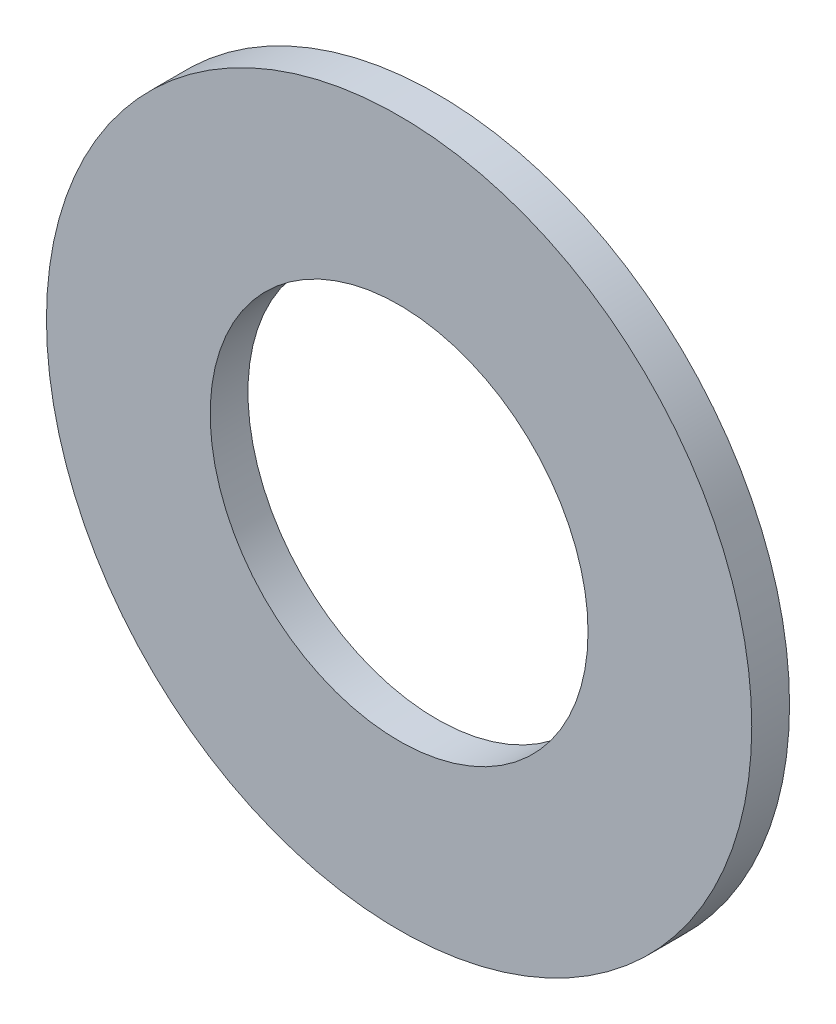
ISO-10303-21;
HEADER;
FILE_DESCRIPTION(('STEP AP214'),'2;1');
FILE_NAME('part.step','',(''),(''),'','','');
FILE_SCHEMA(('AUTOMOTIVE_DESIGN { 1 0 10303 214 1 1 1 1 }'));
ENDSEC;
DATA;
#1=APPLICATION_CONTEXT('core data for automotive mechanical design processes');
#2=APPLICATION_PROTOCOL_DEFINITION('international standard','automotive_design',2000,#1);
#3=PRODUCT_CONTEXT('',#1,'mechanical');
#4=PRODUCT('Part','Part','',(#3));
#5=PRODUCT_RELATED_PRODUCT_CATEGORY('part','',(#4));
#6=PRODUCT_DEFINITION_FORMATION('','',#4);
#7=PRODUCT_DEFINITION_CONTEXT('part definition',#1,'design');
#8=PRODUCT_DEFINITION('design','',#6,#7);
#9=PRODUCT_DEFINITION_SHAPE('','',#8);
#10=(LENGTH_UNIT() NAMED_UNIT(*) SI_UNIT(.MILLI.,.METRE.));
#11=(NAMED_UNIT(*) PLANE_ANGLE_UNIT() SI_UNIT($,.RADIAN.));
#12=(NAMED_UNIT(*) SI_UNIT($,.STERADIAN.) SOLID_ANGLE_UNIT());
#13=UNCERTAINTY_MEASURE_WITH_UNIT(LENGTH_MEASURE(1.E-05),#10,'distance_accuracy_value','');
#14=(GEOMETRIC_REPRESENTATION_CONTEXT(3) GLOBAL_UNCERTAINTY_ASSIGNED_CONTEXT((#13)) GLOBAL_UNIT_ASSIGNED_CONTEXT((#10,
#11,#12)) REPRESENTATION_CONTEXT('',''));
#15=CARTESIAN_POINT('',(0.,0.,0.));
#16=DIRECTION('',(0.,0.,1.));
#17=DIRECTION('',(1.,0.,0.));
#18=AXIS2_PLACEMENT_3D('',#15,#16,#17);
#19=CARTESIAN_POINT('',(0.,0.,1.5));
#20=DIRECTION('',(0.,0.,1.));
#21=DIRECTION('',(1.,0.,0.));
#22=AXIS2_PLACEMENT_3D('',#19,#20,#21);
#23=PLANE('',#22);
#24=CARTESIAN_POINT('',(0.,0.,1.5));
#25=DIRECTION('',(0.,0.,1.));
#26=DIRECTION('',(1.,0.,0.));
#27=AXIS2_PLACEMENT_3D('',#24,#25,#26);
#28=CIRCLE('',#27,14.);
#29=CARTESIAN_POINT('',(14.,0.,1.5));
#30=VERTEX_POINT('',#29);
#31=EDGE_CURVE('E10',#30,#30,#28,.T.);
#32=ORIENTED_EDGE('',*,*,#31,.T.);
#33=EDGE_LOOP('',(#32));
#34=FACE_BOUND('',#33,.T.);
#35=CARTESIAN_POINT('',(0.,0.,1.5));
#36=DIRECTION('',(0.,0.,1.));
#37=DIRECTION('',(1.,0.,0.));
#38=AXIS2_PLACEMENT_3D('',#35,#36,#37);
#39=CIRCLE('',#38,7.5);
#40=CARTESIAN_POINT('',(7.5,0.,1.5));
#41=VERTEX_POINT('',#40);
#42=EDGE_CURVE('E50',#41,#41,#39,.T.);
#43=ORIENTED_EDGE('',*,*,#42,.F.);
#44=EDGE_LOOP('',(#43));
#45=FACE_BOUND('',#44,.T.);
#46=ADVANCED_FACE('F37',(#34,#45),#23,.T.);
#47=CARTESIAN_POINT('',(0.,0.,0.));
#48=DIRECTION('',(0.,0.,1.));
#49=DIRECTION('',(1.,0.,0.));
#50=AXIS2_PLACEMENT_3D('',#47,#48,#49);
#51=PLANE('',#50);
#52=CARTESIAN_POINT('',(0.,0.,0.));
#53=DIRECTION('',(0.,0.,1.));
#54=DIRECTION('',(1.,0.,0.));
#55=AXIS2_PLACEMENT_3D('',#52,#53,#54);
#56=CIRCLE('',#55,14.);
#57=CARTESIAN_POINT('',(14.,0.,0.));
#58=VERTEX_POINT('',#57);
#59=EDGE_CURVE('E41',#58,#58,#56,.T.);
#60=ORIENTED_EDGE('',*,*,#59,.F.);
#61=EDGE_LOOP('',(#60));
#62=FACE_BOUND('',#61,.T.);
#63=CARTESIAN_POINT('',(0.,0.,0.));
#64=DIRECTION('',(0.,0.,1.));
#65=DIRECTION('',(1.,0.,0.));
#66=AXIS2_PLACEMENT_3D('',#63,#64,#65);
#67=CIRCLE('',#66,7.5);
#68=CARTESIAN_POINT('',(7.5,0.,0.));
#69=VERTEX_POINT('',#68);
#70=EDGE_CURVE('E52',#69,#69,#67,.T.);
#71=ORIENTED_EDGE('',*,*,#70,.T.);
#72=EDGE_LOOP('',(#71));
#73=FACE_BOUND('',#72,.T.);
#74=ADVANCED_FACE('F64',(#62,#73),#51,.F.);
#75=CARTESIAN_POINT('',(0.,0.,1.5));
#76=DIRECTION('',(0.,0.,-1.));
#77=DIRECTION('',(-1.,0.,0.));
#78=AXIS2_PLACEMENT_3D('',#75,#76,#77);
#79=CYLINDRICAL_SURFACE('',#78,14.);
#80=ORIENTED_EDGE('',*,*,#31,.F.);
#81=EDGE_LOOP('',(#80));
#82=FACE_BOUND('',#81,.T.);
#83=ORIENTED_EDGE('',*,*,#59,.T.);
#84=EDGE_LOOP('',(#83));
#85=FACE_BOUND('',#84,.T.);
#86=ADVANCED_FACE('F39',(#82,#85),#79,.T.);
#87=CARTESIAN_POINT('',(0.,0.,1.5));
#88=DIRECTION('',(0.,0.,-1.));
#89=DIRECTION('',(-1.,0.,0.));
#90=AXIS2_PLACEMENT_3D('',#87,#88,#89);
#91=CYLINDRICAL_SURFACE('',#90,7.5);
#92=ORIENTED_EDGE('',*,*,#42,.T.);
#93=EDGE_LOOP('',(#92));
#94=FACE_BOUND('',#93,.T.);
#95=ORIENTED_EDGE('',*,*,#70,.F.);
#96=EDGE_LOOP('',(#95));
#97=FACE_BOUND('',#96,.T.);
#98=ADVANCED_FACE('F60',(#94,#97),#91,.F.);
#99=CLOSED_SHELL('',(#46,#74,#86,#98));
#100=MANIFOLD_SOLID_BREP('B2',#99);
#101=ADVANCED_BREP_SHAPE_REPRESENTATION('',(#18,#100),#14);
#102=SHAPE_DEFINITION_REPRESENTATION(#9,#101);
ENDSEC;
END-ISO-10303-21;
